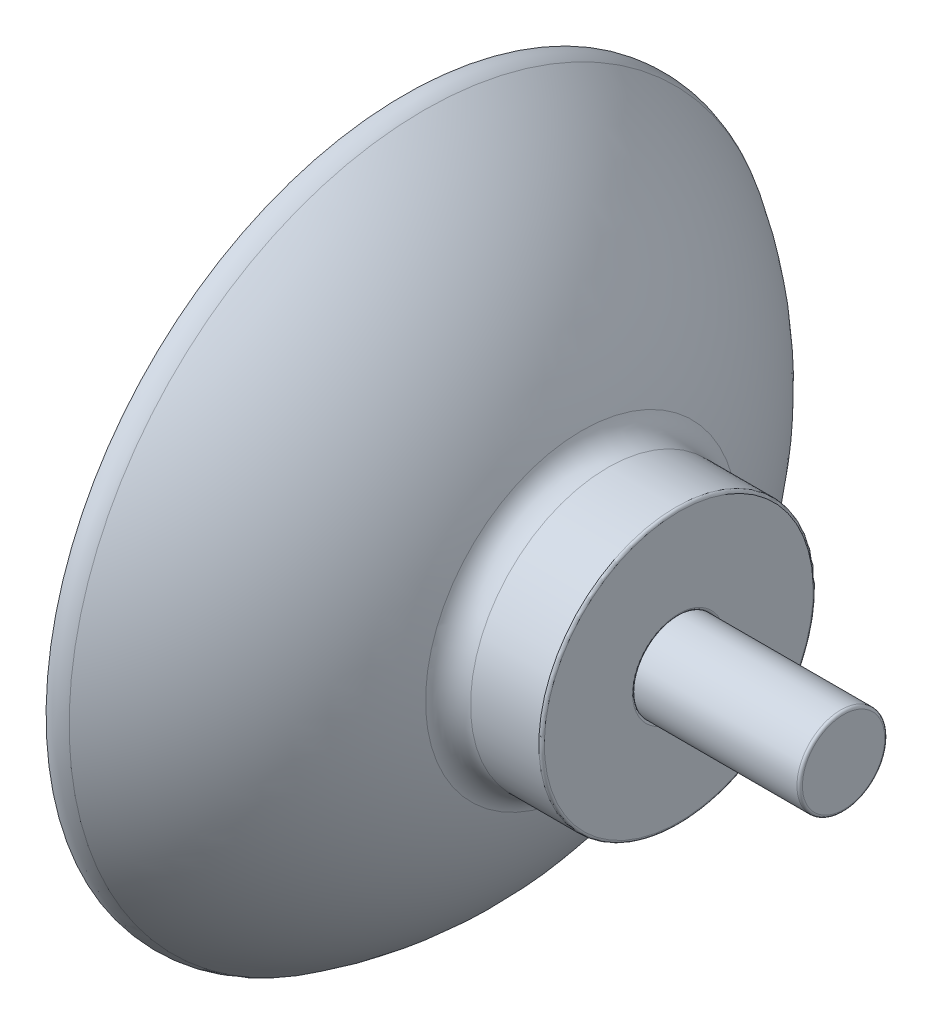
ISO-10303-21;
HEADER;
FILE_DESCRIPTION(('STEP AP214'),'2;1');
FILE_NAME('part.step','',(''),(''),'','','');
FILE_SCHEMA(('AUTOMOTIVE_DESIGN { 1 0 10303 214 1 1 1 1 }'));
ENDSEC;
DATA;
#1=APPLICATION_CONTEXT('core data for automotive mechanical design processes');
#2=APPLICATION_PROTOCOL_DEFINITION('international standard','automotive_design',2000,#1);
#3=PRODUCT_CONTEXT('',#1,'mechanical');
#4=PRODUCT('Part','Part','',(#3));
#5=PRODUCT_RELATED_PRODUCT_CATEGORY('part','',(#4));
#6=PRODUCT_DEFINITION_FORMATION('','',#4);
#7=PRODUCT_DEFINITION_CONTEXT('part definition',#1,'design');
#8=PRODUCT_DEFINITION('design','',#6,#7);
#9=PRODUCT_DEFINITION_SHAPE('','',#8);
#10=(LENGTH_UNIT() NAMED_UNIT(*) SI_UNIT(.MILLI.,.METRE.));
#11=(NAMED_UNIT(*) PLANE_ANGLE_UNIT() SI_UNIT($,.RADIAN.));
#12=(NAMED_UNIT(*) SI_UNIT($,.STERADIAN.) SOLID_ANGLE_UNIT());
#13=UNCERTAINTY_MEASURE_WITH_UNIT(LENGTH_MEASURE(1.E-05),#10,'distance_accuracy_value','');
#14=(GEOMETRIC_REPRESENTATION_CONTEXT(3) GLOBAL_UNCERTAINTY_ASSIGNED_CONTEXT((#13)) GLOBAL_UNIT_ASSIGNED_CONTEXT((#10,
#11,#12)) REPRESENTATION_CONTEXT('',''));
#15=CARTESIAN_POINT('',(0.,0.,0.));
#16=DIRECTION('',(0.,0.,1.));
#17=DIRECTION('',(1.,0.,0.));
#18=AXIS2_PLACEMENT_3D('',#15,#16,#17);
#19=CARTESIAN_POINT('',(5.,0.,0.));
#20=DIRECTION('',(1.,0.,0.));
#21=DIRECTION('',(0.,1.,0.));
#22=AXIS2_PLACEMENT_3D('',#19,#20,#21);
#23=PLANE('',#22);
#24=CARTESIAN_POINT('',(5.,0.,0.));
#25=DIRECTION('',(1.,0.,0.));
#26=DIRECTION('',(0.,1.,0.));
#27=AXIS2_PLACEMENT_3D('',#24,#25,#26);
#28=CIRCLE('',#27,2.525);
#29=CARTESIAN_POINT('',(5.,2.525,0.));
#30=VERTEX_POINT('',#29);
#31=EDGE_CURVE('E84',#30,#30,#28,.F.);
#32=ORIENTED_EDGE('',*,*,#31,.T.);
#33=EDGE_LOOP('',(#32));
#34=FACE_BOUND('',#33,.T.);
#35=CARTESIAN_POINT('',(5.,0.,0.));
#36=DIRECTION('',(1.,0.,0.));
#37=DIRECTION('',(0.,1.,0.));
#38=AXIS2_PLACEMENT_3D('',#35,#36,#37);
#39=CIRCLE('',#38,7.35);
#40=CARTESIAN_POINT('',(5.,7.35,0.));
#41=VERTEX_POINT('',#40);
#42=EDGE_CURVE('E88',#41,#41,#39,.T.);
#43=ORIENTED_EDGE('',*,*,#42,.T.);
#44=EDGE_LOOP('',(#43));
#45=FACE_BOUND('',#44,.T.);
#46=ADVANCED_FACE('F42',(#34,#45),#23,.T.);
#47=CARTESIAN_POINT('',(0.,0.,0.));
#48=DIRECTION('',(1.,0.,0.));
#49=DIRECTION('',(0.,1.,0.));
#50=AXIS2_PLACEMENT_3D('',#47,#48,#49);
#51=CYLINDRICAL_SURFACE('',#50,7.5);
#52=CARTESIAN_POINT('',(1.11723092580122,0.,0.));
#53=DIRECTION('',(1.,0.,0.));
#54=DIRECTION('',(0.,1.,0.));
#55=AXIS2_PLACEMENT_3D('',#52,#53,#54);
#56=CIRCLE('',#55,7.5);
#57=CARTESIAN_POINT('',(1.11723092580122,7.5,0.));
#58=VERTEX_POINT('',#57);
#59=EDGE_CURVE('E68',#58,#58,#56,.T.);
#60=ORIENTED_EDGE('',*,*,#59,.T.);
#61=EDGE_LOOP('',(#60));
#62=FACE_BOUND('',#61,.T.);
#63=CARTESIAN_POINT('',(4.85,0.,0.));
#64=DIRECTION('',(1.,0.,0.));
#65=DIRECTION('',(0.,1.,0.));
#66=AXIS2_PLACEMENT_3D('',#63,#64,#65);
#67=CIRCLE('',#66,7.5);
#68=CARTESIAN_POINT('',(4.85,7.5,0.));
#69=VERTEX_POINT('',#68);
#70=EDGE_CURVE('E80',#69,#69,#67,.F.);
#71=ORIENTED_EDGE('',*,*,#70,.T.);
#72=EDGE_LOOP('',(#71));
#73=FACE_BOUND('',#72,.T.);
#74=ADVANCED_FACE('F147',(#62,#73),#51,.T.);
#75=CARTESIAN_POINT('',(0.,0.,0.));
#76=DIRECTION('',(1.,0.,0.));
#77=DIRECTION('',(0.,1.,0.));
#78=AXIS2_PLACEMENT_3D('',#75,#76,#77);
#79=PLANE('',#78);
#80=CARTESIAN_POINT('',(0.,0.,0.));
#81=DIRECTION('',(1.,0.,0.));
#82=DIRECTION('',(0.,1.,0.));
#83=AXIS2_PLACEMENT_3D('',#80,#81,#82);
#84=CIRCLE('',#83,3.98943639187573);
#85=CARTESIAN_POINT('',(0.,3.98943639187573,0.));
#86=VERTEX_POINT('',#85);
#87=EDGE_CURVE('E92',#86,#86,#84,.F.);
#88=ORIENTED_EDGE('',*,*,#87,.T.);
#89=EDGE_LOOP('',(#88));
#90=FACE_BOUND('',#89,.T.);
#91=ADVANCED_FACE('F153',(#90),#79,.F.);
#92=CARTESIAN_POINT('',(-19.3122304000596,0.,0.));
#93=DIRECTION('',(1.,0.,0.));
#94=DIRECTION('',(0.,1.,0.));
#95=AXIS2_PLACEMENT_3D('',#92,#93,#94);
#96=DEGENERATE_TOROIDAL_SURFACE('',#95,2.30021567995232,20.,.T.);
#97=CARTESIAN_POINT('',(-8.92809859857826,0.,0.));
#98=DIRECTION('',(-1.,0.,0.));
#99=DIRECTION('',(0.,-1.,0.));
#100=AXIS2_PLACEMENT_3D('',#97,#98,#99);
#101=CIRCLE('',#100,19.3931910420554);
#102=CARTESIAN_POINT('',(-8.92809859857826,-19.3931910420554,0.));
#103=VERTEX_POINT('',#102);
#104=EDGE_CURVE('E72',#103,#103,#101,.F.);
#105=ORIENTED_EDGE('',*,*,#104,.T.);
#106=EDGE_LOOP('',(#105));
#107=FACE_BOUND('',#106,.T.);
#108=CARTESIAN_POINT('',(-0.308080329491398,0.,0.));
#109=DIRECTION('',(-1.,0.,0.));
#110=DIRECTION('',(0.,-1.,0.));
#111=AXIS2_PLACEMENT_3D('',#108,#109,#110);
#112=CIRCLE('',#111,8.53257318697341);
#113=CARTESIAN_POINT('',(-0.308080329491397,-8.53257318697341,0.));
#114=VERTEX_POINT('',#113);
#115=EDGE_CURVE('E76',#114,#114,#112,.T.);
#116=ORIENTED_EDGE('',*,*,#115,.T.);
#117=EDGE_LOOP('',(#116));
#118=FACE_BOUND('',#117,.T.);
#119=ADVANCED_FACE('F160',(#107,#118),#96,.T.);
#120=CARTESIAN_POINT('',(-21.7835977429209,0.,0.));
#121=DIRECTION('',(1.,0.,0.));
#122=DIRECTION('',(0.,1.,0.));
#123=AXIS2_PLACEMENT_3D('',#120,#121,#122);
#124=DEGENERATE_TOROIDAL_SURFACE('',#123,0.921872423922007,22.,.T.);
#125=CARTESIAN_POINT('',(-9.93081443166763,0.,0.));
#126=DIRECTION('',(-1.,0.,0.));
#127=DIRECTION('',(0.,-1.,0.));
#128=AXIS2_PLACEMENT_3D('',#125,#126,#127);
#129=CIRCLE('',#128,19.4559364082854);
#130=CARTESIAN_POINT('',(-9.93081443166763,-19.4559364082854,0.));
#131=VERTEX_POINT('',#130);
#132=EDGE_CURVE('E96',#131,#131,#129,.T.);
#133=ORIENTED_EDGE('',*,*,#132,.T.);
#134=EDGE_LOOP('',(#133));
#135=FACE_BOUND('',#134,.T.);
#136=CARTESIAN_POINT('',(-0.0014855990188474,0.,0.));
#137=DIRECTION('',(-1.,0.,0.));
#138=DIRECTION('',(0.,-1.,0.));
#139=AXIS2_PLACEMENT_3D('',#136,#137,#138);
#140=CIRCLE('',#139,4.01049518341775);
#141=CARTESIAN_POINT('',(-0.00148559901884691,-4.01049518341775,0.));
#142=VERTEX_POINT('',#141);
#143=EDGE_CURVE('E100',#142,#142,#140,.F.);
#144=ORIENTED_EDGE('',*,*,#143,.T.);
#145=EDGE_LOOP('',(#144));
#146=FACE_BOUND('',#145,.T.);
#147=ADVANCED_FACE('F156',(#135,#146),#124,.F.);
#148=CARTESIAN_POINT('',(-9.85,0.,0.));
#149=DIRECTION('',(-1.,0.,0.));
#150=DIRECTION('',(0.,-1.,0.));
#151=AXIS2_PLACEMENT_3D('',#148,#149,#150);
#152=TOROIDAL_SURFACE('',#151,19.5823050263606,0.15);
#153=ORIENTED_EDGE('',*,*,#132,.F.);
#154=EDGE_LOOP('',(#153));
#155=FACE_BOUND('',#154,.T.);
#156=CARTESIAN_POINT('',(-10.,0.,0.));
#157=DIRECTION('',(-1.,0.,0.));
#158=DIRECTION('',(0.,-1.,0.));
#159=AXIS2_PLACEMENT_3D('',#156,#157,#158);
#160=CIRCLE('',#159,19.5823050263606);
#161=CARTESIAN_POINT('',(-10.,-19.5823050263606,0.));
#162=VERTEX_POINT('',#161);
#163=EDGE_CURVE('E104',#162,#162,#160,.F.);
#164=ORIENTED_EDGE('',*,*,#163,.F.);
#165=EDGE_LOOP('',(#164));
#166=FACE_BOUND('',#165,.T.);
#167=ADVANCED_FACE('F166',(#155,#166),#152,.T.);
#168=CARTESIAN_POINT('',(-0.150000000000001,0.,0.));
#169=DIRECTION('',(1.,0.,0.));
#170=DIRECTION('',(0.,1.,0.));
#171=AXIS2_PLACEMENT_3D('',#168,#169,#170);
#172=TOROIDAL_SURFACE('',#171,3.98943639187573,0.15);
#173=ORIENTED_EDGE('',*,*,#143,.F.);
#174=EDGE_LOOP('',(#173));
#175=FACE_BOUND('',#174,.T.);
#176=ORIENTED_EDGE('',*,*,#87,.F.);
#177=EDGE_LOOP('',(#176));
#178=FACE_BOUND('',#177,.T.);
#179=ADVANCED_FACE('F170',(#175,#178),#172,.F.);
#180=CARTESIAN_POINT('',(4.85,0.,0.));
#181=DIRECTION('',(1.,0.,0.));
#182=DIRECTION('',(0.,1.,0.));
#183=AXIS2_PLACEMENT_3D('',#180,#181,#182);
#184=TOROIDAL_SURFACE('',#183,2.525,0.15);
#185=CARTESIAN_POINT('',(4.93291561975889,0.,0.));
#186=DIRECTION('',(-1.,0.,0.));
#187=DIRECTION('',(0.,-1.,0.));
#188=AXIS2_PLACEMENT_3D('',#185,#186,#187);
#189=CIRCLE('',#188,2.4);
#190=CARTESIAN_POINT('',(4.93291561975889,-2.4,0.));
#191=VERTEX_POINT('',#190);
#192=EDGE_CURVE('E64',#191,#191,#189,.F.);
#193=ORIENTED_EDGE('',*,*,#192,.F.);
#194=EDGE_LOOP('',(#193));
#195=FACE_BOUND('',#194,.T.);
#196=ORIENTED_EDGE('',*,*,#31,.F.);
#197=EDGE_LOOP('',(#196));
#198=FACE_BOUND('',#197,.T.);
#199=ADVANCED_FACE('F173',(#195,#198),#184,.T.);
#200=CARTESIAN_POINT('',(4.85,0.,0.));
#201=DIRECTION('',(1.,0.,0.));
#202=DIRECTION('',(0.,1.,0.));
#203=AXIS2_PLACEMENT_3D('',#200,#201,#202);
#204=TOROIDAL_SURFACE('',#203,7.35,0.15);
#205=ORIENTED_EDGE('',*,*,#70,.F.);
#206=EDGE_LOOP('',(#205));
#207=FACE_BOUND('',#206,.T.);
#208=ORIENTED_EDGE('',*,*,#42,.F.);
#209=EDGE_LOOP('',(#208));
#210=FACE_BOUND('',#209,.T.);
#211=ADVANCED_FACE('F178',(#207,#210),#204,.T.);
#212=CARTESIAN_POINT('',(-9.70690848368936,0.,0.));
#213=DIRECTION('',(-1.,0.,0.));
#214=DIRECTION('',(0.,-1.,0.));
#215=AXIS2_PLACEMENT_3D('',#212,#213,#214);
#216=TOROIDAL_SURFACE('',#215,18.1112178898977,1.5);
#217=ORIENTED_EDGE('',*,*,#163,.T.);
#218=EDGE_LOOP('',(#217));
#219=FACE_BOUND('',#218,.T.);
#220=ORIENTED_EDGE('',*,*,#104,.F.);
#221=EDGE_LOOP('',(#220));
#222=FACE_BOUND('',#221,.T.);
#223=ADVANCED_FACE('F182',(#219,#222),#216,.T.);
#224=CARTESIAN_POINT('',(1.11723092580122,0.,0.));
#225=DIRECTION('',(1.,0.,0.));
#226=DIRECTION('',(0.,1.,0.));
#227=AXIS2_PLACEMENT_3D('',#224,#225,#226);
#228=TOROIDAL_SURFACE('',#227,9.,1.5);
#229=ORIENTED_EDGE('',*,*,#115,.F.);
#230=EDGE_LOOP('',(#229));
#231=FACE_BOUND('',#230,.T.);
#232=ORIENTED_EDGE('',*,*,#59,.F.);
#233=EDGE_LOOP('',(#232));
#234=FACE_BOUND('',#233,.T.);
#235=ADVANCED_FACE('F144',(#231,#234),#228,.F.);
#236=CARTESIAN_POINT('',(14.0071744324273,0.,-2.4));
#237=DIRECTION('',(1.,0.,0.));
#238=DIRECTION('',(0.,0.,-1.));
#239=AXIS2_PLACEMENT_3D('',#236,#237,#238);
#240=PLANE('',#239);
#241=CARTESIAN_POINT('',(14.0071744324273,0.,0.));
#242=DIRECTION('',(1.,0.,0.));
#243=DIRECTION('',(0.,0.,-1.));
#244=AXIS2_PLACEMENT_3D('',#241,#242,#243);
#245=CIRCLE('',#244,2.25);
#246=CARTESIAN_POINT('',(14.0071744324273,0.,-2.25));
#247=VERTEX_POINT('',#246);
#248=EDGE_CURVE('E51',#247,#247,#245,.T.);
#249=ORIENTED_EDGE('',*,*,#248,.T.);
#250=EDGE_LOOP('',(#249));
#251=FACE_BOUND('',#250,.T.);
#252=ADVANCED_FACE('F138',(#251),#240,.T.);
#253=CARTESIAN_POINT('',(14.0071744324273,0.,0.));
#254=DIRECTION('',(1.,0.,0.));
#255=DIRECTION('',(0.,0.,-1.));
#256=AXIS2_PLACEMENT_3D('',#253,#254,#255);
#257=CYLINDRICAL_SURFACE('',#256,2.4);
#258=CARTESIAN_POINT('',(13.8571744324273,0.,0.));
#259=DIRECTION('',(1.,0.,0.));
#260=DIRECTION('',(0.,0.,-1.));
#261=AXIS2_PLACEMENT_3D('',#258,#259,#260);
#262=CIRCLE('',#261,2.4);
#263=CARTESIAN_POINT('',(13.8571744324273,0.,-2.4));
#264=VERTEX_POINT('',#263);
#265=EDGE_CURVE('E10',#264,#264,#262,.F.);
#266=ORIENTED_EDGE('',*,*,#265,.T.);
#267=EDGE_LOOP('',(#266));
#268=FACE_BOUND('',#267,.T.);
#269=ORIENTED_EDGE('',*,*,#192,.T.);
#270=EDGE_LOOP('',(#269));
#271=FACE_BOUND('',#270,.T.);
#272=ADVANCED_FACE('F133',(#268,#271),#257,.T.);
#273=CARTESIAN_POINT('',(13.8571744324273,0.,0.));
#274=DIRECTION('',(1.,0.,0.));
#275=DIRECTION('',(0.,0.,-1.));
#276=AXIS2_PLACEMENT_3D('',#273,#274,#275);
#277=TOROIDAL_SURFACE('',#276,2.25,0.15);
#278=ORIENTED_EDGE('',*,*,#265,.F.);
#279=EDGE_LOOP('',(#278));
#280=FACE_BOUND('',#279,.T.);
#281=ORIENTED_EDGE('',*,*,#248,.F.);
#282=EDGE_LOOP('',(#281));
#283=FACE_BOUND('',#282,.T.);
#284=ADVANCED_FACE('F44',(#280,#283),#277,.T.);
#285=CLOSED_SHELL('',(#46,#74,#91,#119,#147,#167,#179,#199,#211,#223,#235,#252,#272,#284));
#286=CARTESIAN_POINT('',(4.00717443242726,0.,-4.76));
#287=DIRECTION('',(1.,0.,0.));
#288=DIRECTION('',(0.,0.,-1.));
#289=AXIS2_PLACEMENT_3D('',#286,#287,#288);
#290=PLANE('',#289);
#291=CARTESIAN_POINT('',(4.00717443242726,0.,0.));
#292=DIRECTION('',(1.,0.,0.));
#293=DIRECTION('',(0.,0.,-1.));
#294=AXIS2_PLACEMENT_3D('',#291,#292,#293);
#295=CIRCLE('',#294,2.4);
#296=CARTESIAN_POINT('',(4.00717443242726,0.,-2.4));
#297=VERTEX_POINT('',#296);
#298=EDGE_CURVE('E108',#297,#297,#295,.T.);
#299=ORIENTED_EDGE('',*,*,#298,.F.);
#300=EDGE_LOOP('',(#299));
#301=FACE_BOUND('',#300,.T.);
#302=CARTESIAN_POINT('',(4.00717443242726,0.,0.));
#303=DIRECTION('',(-1.,0.,0.));
#304=DIRECTION('',(0.,0.,1.));
#305=AXIS2_PLACEMENT_3D('',#302,#303,#304);
#306=CIRCLE('',#305,2.47916489066747);
#307=CARTESIAN_POINT('',(4.00717443242726,0.,2.47916489066747));
#308=VERTEX_POINT('',#307);
#309=EDGE_CURVE('E56',#308,#308,#306,.F.);
#310=ORIENTED_EDGE('',*,*,#309,.T.);
#311=EDGE_LOOP('',(#310));
#312=FACE_BOUND('',#311,.T.);
#313=ADVANCED_FACE('F118',(#301,#312),#290,.T.);
#314=CARTESIAN_POINT('',(4.06708438024112,0.,0.));
#315=DIRECTION('',(1.,0.,0.));
#316=DIRECTION('',(0.,1.,0.));
#317=AXIS2_PLACEMENT_3D('',#314,#315,#316);
#318=CIRCLE('',#317,2.4);
#319=CARTESIAN_POINT('',(4.06708438024112,2.4,0.));
#320=VERTEX_POINT('',#319);
#321=EDGE_CURVE('E61',#320,#320,#318,.F.);
#322=ORIENTED_EDGE('',*,*,#321,.T.);
#323=EDGE_LOOP('',(#322));
#324=FACE_BOUND('',#323,.T.);
#325=ORIENTED_EDGE('',*,*,#298,.T.);
#326=EDGE_LOOP('',(#325));
#327=FACE_BOUND('',#326,.T.);
#328=ADVANCED_FACE('F116',(#324,#327),#257,.T.);
#329=CARTESIAN_POINT('',(4.15,0.,0.));
#330=DIRECTION('',(1.,0.,0.));
#331=DIRECTION('',(0.,1.,0.));
#332=AXIS2_PLACEMENT_3D('',#329,#330,#331);
#333=TOROIDAL_SURFACE('',#332,2.525,0.15);
#334=ORIENTED_EDGE('',*,*,#309,.F.);
#335=EDGE_LOOP('',(#334));
#336=FACE_BOUND('',#335,.T.);
#337=ORIENTED_EDGE('',*,*,#321,.F.);
#338=EDGE_LOOP('',(#337));
#339=FACE_BOUND('',#338,.T.);
#340=ADVANCED_FACE('F125',(#336,#339),#333,.T.);
#341=CLOSED_SHELL('',(#313,#328,#340));
#342=ORIENTED_CLOSED_SHELL('',*,#341,.T.);
#343=BREP_WITH_VOIDS('B2',#285,(#342));
#344=ADVANCED_BREP_SHAPE_REPRESENTATION('',(#18,#343),#14);
#345=SHAPE_DEFINITION_REPRESENTATION(#9,#344);
ENDSEC;
END-ISO-10303-21;
